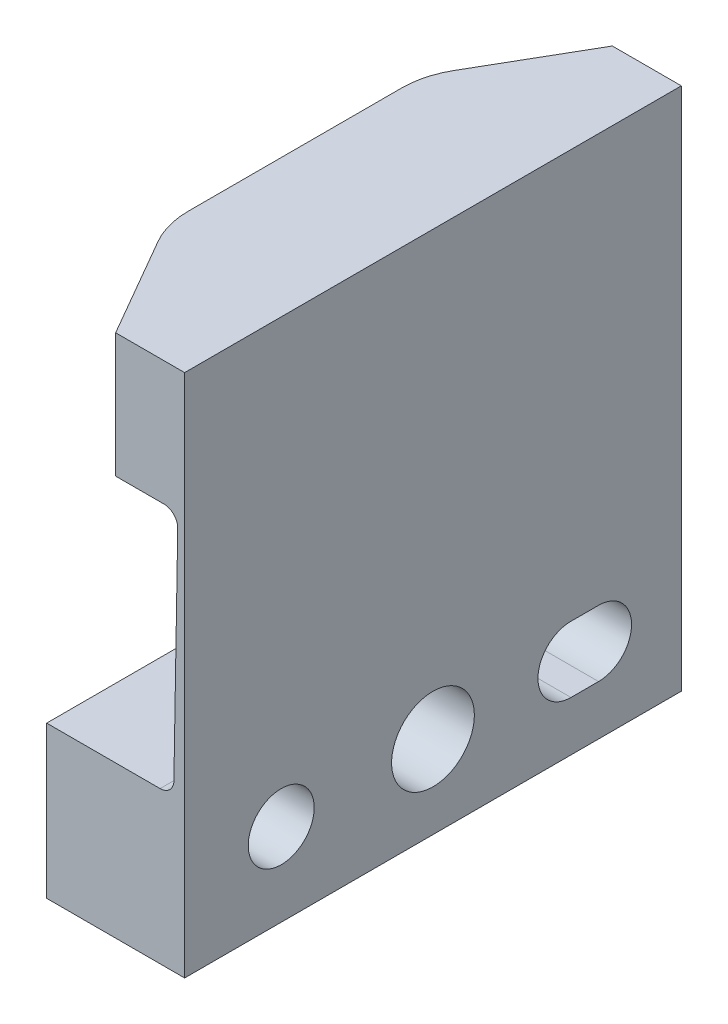
ISO-10303-21;
HEADER;
FILE_DESCRIPTION(('STEP AP214'),'2;1');
FILE_NAME('part.step','',(''),(''),'','','');
FILE_SCHEMA(('AUTOMOTIVE_DESIGN { 1 0 10303 214 1 1 1 1 }'));
ENDSEC;
DATA;
#1=APPLICATION_CONTEXT('core data for automotive mechanical design processes');
#2=APPLICATION_PROTOCOL_DEFINITION('international standard','automotive_design',2000,#1);
#3=PRODUCT_CONTEXT('',#1,'mechanical');
#4=PRODUCT('Part','Part','',(#3));
#5=PRODUCT_RELATED_PRODUCT_CATEGORY('part','',(#4));
#6=PRODUCT_DEFINITION_FORMATION('','',#4);
#7=PRODUCT_DEFINITION_CONTEXT('part definition',#1,'design');
#8=PRODUCT_DEFINITION('design','',#6,#7);
#9=PRODUCT_DEFINITION_SHAPE('','',#8);
#10=(LENGTH_UNIT() NAMED_UNIT(*) SI_UNIT(.MILLI.,.METRE.));
#11=(NAMED_UNIT(*) PLANE_ANGLE_UNIT() SI_UNIT($,.RADIAN.));
#12=(NAMED_UNIT(*) SI_UNIT($,.STERADIAN.) SOLID_ANGLE_UNIT());
#13=UNCERTAINTY_MEASURE_WITH_UNIT(LENGTH_MEASURE(1.E-05),#10,'distance_accuracy_value','');
#14=(GEOMETRIC_REPRESENTATION_CONTEXT(3) GLOBAL_UNCERTAINTY_ASSIGNED_CONTEXT((#13)) GLOBAL_UNIT_ASSIGNED_CONTEXT((#10,
#11,#12)) REPRESENTATION_CONTEXT('',''));
#15=CARTESIAN_POINT('',(0.,0.,0.));
#16=DIRECTION('',(0.,0.,1.));
#17=DIRECTION('',(1.,0.,0.));
#18=AXIS2_PLACEMENT_3D('',#15,#16,#17);
#19=CARTESIAN_POINT('',(0.,19.5,9.));
#20=DIRECTION('',(1.,0.,0.));
#21=DIRECTION('',(0.,1.,0.));
#22=AXIS2_PLACEMENT_3D('',#19,#20,#21);
#23=PLANE('',#22);
#24=DIRECTION('',(0.,0.,1.));
#25=VECTOR('',#24,1.);
#26=CARTESIAN_POINT('',(0.,19.,-3.86602540378444));
#27=LINE('',#26,#25);
#28=CARTESIAN_POINT('',(0.,19.,-3.86602540378444));
#29=VERTEX_POINT('',#28);
#30=CARTESIAN_POINT('',(0.,19.,3.86602540378444));
#31=VERTEX_POINT('',#30);
#32=EDGE_CURVE('E172',#29,#31,#27,.T.);
#33=ORIENTED_EDGE('',*,*,#32,.F.);
#34=DIRECTION('',(0.,-1.,0.));
#35=VECTOR('',#34,1.);
#36=CARTESIAN_POINT('',(0.,19.5,-3.86602540378444));
#37=LINE('',#36,#35);
#38=CARTESIAN_POINT('',(0.,14.5,-3.86602540378444));
#39=VERTEX_POINT('',#38);
#40=EDGE_CURVE('E182',#39,#29,#37,.F.);
#41=ORIENTED_EDGE('',*,*,#40,.F.);
#42=DIRECTION('',(0.,0.,-1.));
#43=VECTOR('',#42,1.);
#44=CARTESIAN_POINT('',(0.,14.5,9.));
#45=LINE('',#44,#43);
#46=CARTESIAN_POINT('',(0.,14.5,3.86602540378444));
#47=VERTEX_POINT('',#46);
#48=EDGE_CURVE('E232',#47,#39,#45,.T.);
#49=ORIENTED_EDGE('',*,*,#48,.F.);
#50=DIRECTION('',(0.,-1.,0.));
#51=VECTOR('',#50,1.);
#52=CARTESIAN_POINT('',(0.,19.5,3.86602540378444));
#53=LINE('',#52,#51);
#54=EDGE_CURVE('E184',#47,#31,#53,.F.);
#55=ORIENTED_EDGE('',*,*,#54,.T.);
#56=EDGE_LOOP('',(#33,#41,#49,#55));
#57=FACE_BOUND('',#56,.T.);
#58=ADVANCED_FACE('F48',(#57),#23,.F.);
#59=CARTESIAN_POINT('',(5.,0.,9.));
#60=DIRECTION('',(-1.,0.,0.));
#61=DIRECTION('',(0.,-1.,0.));
#62=AXIS2_PLACEMENT_3D('',#59,#60,#61);
#63=PLANE('',#62);
#64=CARTESIAN_POINT('',(5.,3.,5.5));
#65=DIRECTION('',(1.,0.,0.));
#66=DIRECTION('',(0.,0.,-1.));
#67=AXIS2_PLACEMENT_3D('',#64,#65,#66);
#68=CIRCLE('',#67,1.195625);
#69=CARTESIAN_POINT('',(5.,3.,4.304375));
#70=VERTEX_POINT('',#69);
#71=EDGE_CURVE('E296',#70,#70,#68,.T.);
#72=ORIENTED_EDGE('',*,*,#71,.F.);
#73=EDGE_LOOP('',(#72));
#74=FACE_BOUND('',#73,.T.);
#75=CARTESIAN_POINT('',(5.,3.,0.));
#76=DIRECTION('',(1.,0.,0.));
#77=DIRECTION('',(0.,0.,-1.));
#78=AXIS2_PLACEMENT_3D('',#75,#76,#77);
#79=CIRCLE('',#78,1.5);
#80=CARTESIAN_POINT('',(5.,3.,-1.5));
#81=VERTEX_POINT('',#80);
#82=EDGE_CURVE('E286',#81,#81,#79,.T.);
#83=ORIENTED_EDGE('',*,*,#82,.F.);
#84=EDGE_LOOP('',(#83));
#85=FACE_BOUND('',#84,.T.);
#86=DIRECTION('',(0.,0.,-1.));
#87=VECTOR('',#86,1.);
#88=CARTESIAN_POINT('',(5.,1.804375,-5.));
#89=LINE('',#88,#87);
#90=CARTESIAN_POINT('',(5.,1.804375,-5.));
#91=VERTEX_POINT('',#90);
#92=CARTESIAN_POINT('',(5.,1.804375,-6.));
#93=VERTEX_POINT('',#92);
#94=EDGE_CURVE('E276',#91,#93,#89,.T.);
#95=ORIENTED_EDGE('',*,*,#94,.F.);
#96=CARTESIAN_POINT('',(5.,3.,-5.));
#97=DIRECTION('',(1.,0.,0.));
#98=DIRECTION('',(0.,0.,-1.));
#99=AXIS2_PLACEMENT_3D('',#96,#97,#98);
#100=CIRCLE('',#99,1.195625);
#101=CARTESIAN_POINT('',(5.,4.195625,-5.));
#102=VERTEX_POINT('',#101);
#103=EDGE_CURVE('E262',#102,#91,#100,.T.);
#104=ORIENTED_EDGE('',*,*,#103,.F.);
#105=DIRECTION('',(0.,0.,1.));
#106=VECTOR('',#105,1.);
#107=CARTESIAN_POINT('',(5.,4.195625,-5.));
#108=LINE('',#107,#106);
#109=CARTESIAN_POINT('',(5.,4.195625,-6.));
#110=VERTEX_POINT('',#109);
#111=EDGE_CURVE('E267',#110,#102,#108,.T.);
#112=ORIENTED_EDGE('',*,*,#111,.F.);
#113=CARTESIAN_POINT('',(5.,3.,-6.));
#114=DIRECTION('',(1.,0.,0.));
#115=DIRECTION('',(0.,0.,-1.));
#116=AXIS2_PLACEMENT_3D('',#113,#114,#115);
#117=CIRCLE('',#116,1.195625);
#118=EDGE_CURVE('E279',#93,#110,#117,.T.);
#119=ORIENTED_EDGE('',*,*,#118,.F.);
#120=EDGE_LOOP('',(#95,#104,#112,#119));
#121=FACE_BOUND('',#120,.T.);
#122=DIRECTION('',(0.,0.,-1.));
#123=VECTOR('',#122,1.);
#124=CARTESIAN_POINT('',(5.,19.,9.));
#125=LINE('',#124,#123);
#126=CARTESIAN_POINT('',(5.,19.,9.));
#127=VERTEX_POINT('',#126);
#128=CARTESIAN_POINT('',(5.,19.,-9.));
#129=VERTEX_POINT('',#128);
#130=EDGE_CURVE('E257',#127,#129,#125,.T.);
#131=ORIENTED_EDGE('',*,*,#130,.F.);
#132=DIRECTION('',(0.,1.,0.));
#133=VECTOR('',#132,1.);
#134=CARTESIAN_POINT('',(5.,0.,9.));
#135=LINE('',#134,#133);
#136=CARTESIAN_POINT('',(5.,0.,9.));
#137=VERTEX_POINT('',#136);
#138=EDGE_CURVE('E215',#137,#127,#135,.T.);
#139=ORIENTED_EDGE('',*,*,#138,.F.);
#140=DIRECTION('',(0.,0.,-1.));
#141=VECTOR('',#140,1.);
#142=CARTESIAN_POINT('',(5.,0.,9.));
#143=LINE('',#142,#141);
#144=CARTESIAN_POINT('',(5.,0.,-9.));
#145=VERTEX_POINT('',#144);
#146=EDGE_CURVE('E218',#137,#145,#143,.T.);
#147=ORIENTED_EDGE('',*,*,#146,.T.);
#148=DIRECTION('',(0.,1.,0.));
#149=VECTOR('',#148,1.);
#150=CARTESIAN_POINT('',(5.,0.,-9.));
#151=LINE('',#150,#149);
#152=EDGE_CURVE('E325',#145,#129,#151,.T.);
#153=ORIENTED_EDGE('',*,*,#152,.T.);
#154=EDGE_LOOP('',(#131,#139,#147,#153));
#155=FACE_BOUND('',#154,.T.);
#156=ADVANCED_FACE('F349',(#74,#85,#121,#155),#63,.F.);
#157=CARTESIAN_POINT('',(4.25007615242181,14.,9.));
#158=DIRECTION('',(0.,0.,-1.));
#159=DIRECTION('',(-1.,0.,0.));
#160=AXIS2_PLACEMENT_3D('',#157,#158,#159);
#161=PLANE('',#160);
#162=DIRECTION('',(1.,0.,0.));
#163=VECTOR('',#162,1.);
#164=CARTESIAN_POINT('',(2.50000000000001,19.,9.));
#165=LINE('',#164,#163);
#166=CARTESIAN_POINT('',(2.50000000000001,19.,9.));
#167=VERTEX_POINT('',#166);
#168=EDGE_CURVE('E253',#167,#127,#165,.T.);
#169=ORIENTED_EDGE('',*,*,#168,.F.);
#170=DIRECTION('',(0.,-1.,0.));
#171=VECTOR('',#170,1.);
#172=CARTESIAN_POINT('',(2.50000000000001,14.,9.));
#173=LINE('',#172,#171);
#174=CARTESIAN_POINT('',(2.5,14.5,9.));
#175=VERTEX_POINT('',#174);
#176=EDGE_CURVE('E234',#167,#175,#173,.T.);
#177=ORIENTED_EDGE('',*,*,#176,.T.);
#178=DIRECTION('',(1.,0.,0.));
#179=VECTOR('',#178,1.);
#180=CARTESIAN_POINT('',(0.,14.5,9.));
#181=LINE('',#180,#179);
#182=CARTESIAN_POINT('',(4.25007615242181,14.5,9.));
#183=VERTEX_POINT('',#182);
#184=EDGE_CURVE('E201',#175,#183,#181,.T.);
#185=ORIENTED_EDGE('',*,*,#184,.T.);
#186=CARTESIAN_POINT('',(4.25007615242181,14.,9.));
#187=DIRECTION('',(0.,0.,-1.));
#188=DIRECTION('',(-1.,0.,0.));
#189=AXIS2_PLACEMENT_3D('',#186,#187,#188);
#190=CIRCLE('',#189,0.5);
#191=CARTESIAN_POINT('',(4.75000000000001,13.9912737967814,9.));
#192=VERTEX_POINT('',#191);
#193=EDGE_CURVE('E203',#183,#192,#190,.T.);
#194=ORIENTED_EDGE('',*,*,#193,.T.);
#195=DIRECTION('',(-0.0174524064372768,-0.999847695156391,0.));
#196=VECTOR('',#195,1.);
#197=CARTESIAN_POINT('',(4.75000000000001,13.9912737967814,9.));
#198=LINE('',#197,#196);
#199=CARTESIAN_POINT('',(4.61035948057432,5.99127379678136,9.));
#200=VERTEX_POINT('',#199);
#201=EDGE_CURVE('E205',#192,#200,#198,.T.);
#202=ORIENTED_EDGE('',*,*,#201,.T.);
#203=CARTESIAN_POINT('',(4.11043563299612,6.,9.));
#204=DIRECTION('',(0.,0.,-1.));
#205=DIRECTION('',(-1.,0.,0.));
#206=AXIS2_PLACEMENT_3D('',#203,#204,#205);
#207=CIRCLE('',#206,0.5);
#208=CARTESIAN_POINT('',(4.11043563299612,5.5,9.));
#209=VERTEX_POINT('',#208);
#210=EDGE_CURVE('E207',#200,#209,#207,.T.);
#211=ORIENTED_EDGE('',*,*,#210,.T.);
#212=DIRECTION('',(-1.,0.,0.));
#213=VECTOR('',#212,1.);
#214=CARTESIAN_POINT('',(4.11043563299612,5.5,9.));
#215=LINE('',#214,#213);
#216=CARTESIAN_POINT('',(0.,5.5,9.));
#217=VERTEX_POINT('',#216);
#218=EDGE_CURVE('E209',#209,#217,#215,.T.);
#219=ORIENTED_EDGE('',*,*,#218,.T.);
#220=DIRECTION('',(0.,-1.,0.));
#221=VECTOR('',#220,1.);
#222=CARTESIAN_POINT('',(0.,5.5,9.));
#223=LINE('',#222,#221);
#224=CARTESIAN_POINT('',(0.,0.,9.));
#225=VERTEX_POINT('',#224);
#226=EDGE_CURVE('E211',#217,#225,#223,.T.);
#227=ORIENTED_EDGE('',*,*,#226,.T.);
#228=DIRECTION('',(1.,0.,0.));
#229=VECTOR('',#228,1.);
#230=CARTESIAN_POINT('',(0.,0.,9.));
#231=LINE('',#230,#229);
#232=EDGE_CURVE('E213',#225,#137,#231,.T.);
#233=ORIENTED_EDGE('',*,*,#232,.T.);
#234=ORIENTED_EDGE('',*,*,#138,.T.);
#235=EDGE_LOOP('',(#169,#177,#185,#194,#202,#211,#219,#227,#233,#234));
#236=FACE_BOUND('',#235,.T.);
#237=ADVANCED_FACE('F344',(#236),#161,.F.);
#238=CARTESIAN_POINT('',(2.50000000000001,14.,9.));
#239=DIRECTION('',(0.866025403784438,0.,-0.500000000000001));
#240=DIRECTION('',(-0.500000000000001,0.,-0.866025403784438));
#241=AXIS2_PLACEMENT_3D('',#238,#239,#240);
#242=PLANE('',#241);
#243=ORIENTED_EDGE('',*,*,#176,.F.);
#244=DIRECTION('',(0.500000000000001,0.,0.866025403784438));
#245=VECTOR('',#244,1.);
#246=CARTESIAN_POINT('',(0.401923788646688,19.,5.36602540378444));
#247=LINE('',#246,#245);
#248=CARTESIAN_POINT('',(0.401923788646688,19.,5.36602540378444));
#249=VERTEX_POINT('',#248);
#250=EDGE_CURVE('E246',#249,#167,#247,.T.);
#251=ORIENTED_EDGE('',*,*,#250,.F.);
#252=DIRECTION('',(0.,1.,0.));
#253=VECTOR('',#252,1.);
#254=CARTESIAN_POINT('',(0.401923788646688,14.5,5.36602540378444));
#255=LINE('',#254,#253);
#256=CARTESIAN_POINT('',(0.401923788646687,14.5,5.36602540378444));
#257=VERTEX_POINT('',#256);
#258=EDGE_CURVE('E56',#249,#257,#255,.F.);
#259=ORIENTED_EDGE('',*,*,#258,.T.);
#260=DIRECTION('',(0.500000000000001,0.,0.866025403784438));
#261=VECTOR('',#260,1.);
#262=CARTESIAN_POINT('',(2.50000000000001,14.5,9.));
#263=LINE('',#262,#261);
#264=EDGE_CURVE('E236',#175,#257,#263,.F.);
#265=ORIENTED_EDGE('',*,*,#264,.F.);
#266=EDGE_LOOP('',(#243,#251,#259,#265));
#267=FACE_BOUND('',#266,.T.);
#268=ADVANCED_FACE('F244',(#267),#242,.F.);
#269=CARTESIAN_POINT('',(3.,19.5,3.86602540378444));
#270=DIRECTION('',(0.,1.,0.));
#271=DIRECTION('',(-1.,0.,0.));
#272=AXIS2_PLACEMENT_3D('',#269,#270,#271);
#273=CYLINDRICAL_SURFACE('',#272,3.);
#274=ORIENTED_EDGE('',*,*,#258,.F.);
#275=CARTESIAN_POINT('',(3.,19.,3.86602540378444));
#276=DIRECTION('',(0.,1.,0.));
#277=DIRECTION('',(0.,0.,1.));
#278=AXIS2_PLACEMENT_3D('',#275,#276,#277);
#279=CIRCLE('',#278,3.);
#280=EDGE_CURVE('E185',#31,#249,#279,.T.);
#281=ORIENTED_EDGE('',*,*,#280,.F.);
#282=ORIENTED_EDGE('',*,*,#54,.F.);
#283=CARTESIAN_POINT('',(3.,14.5,3.86602540378444));
#284=DIRECTION('',(0.,1.,0.));
#285=DIRECTION('',(-1.,0.,0.));
#286=AXIS2_PLACEMENT_3D('',#283,#284,#285);
#287=CIRCLE('',#286,3.);
#288=EDGE_CURVE('E13',#257,#47,#287,.F.);
#289=ORIENTED_EDGE('',*,*,#288,.F.);
#290=EDGE_LOOP('',(#274,#281,#282,#289));
#291=FACE_BOUND('',#290,.T.);
#292=ADVANCED_FACE('F50',(#291),#273,.T.);
#293=CARTESIAN_POINT('',(4.25007615242181,14.,-9.));
#294=DIRECTION('',(0.,0.,1.));
#295=DIRECTION('',(-1.,0.,0.));
#296=AXIS2_PLACEMENT_3D('',#293,#294,#295);
#297=PLANE('',#296);
#298=DIRECTION('',(-1.,0.,0.));
#299=VECTOR('',#298,1.);
#300=CARTESIAN_POINT('',(5.,19.,-9.));
#301=LINE('',#300,#299);
#302=CARTESIAN_POINT('',(2.50000000000001,19.,-9.));
#303=VERTEX_POINT('',#302);
#304=EDGE_CURVE('E259',#129,#303,#301,.T.);
#305=ORIENTED_EDGE('',*,*,#304,.F.);
#306=ORIENTED_EDGE('',*,*,#152,.F.);
#307=DIRECTION('',(1.,0.,0.));
#308=VECTOR('',#307,1.);
#309=CARTESIAN_POINT('',(0.,0.,-9.));
#310=LINE('',#309,#308);
#311=CARTESIAN_POINT('',(0.,0.,-9.));
#312=VERTEX_POINT('',#311);
#313=EDGE_CURVE('E322',#312,#145,#310,.T.);
#314=ORIENTED_EDGE('',*,*,#313,.F.);
#315=DIRECTION('',(0.,-1.,0.));
#316=VECTOR('',#315,1.);
#317=CARTESIAN_POINT('',(0.,5.5,-9.));
#318=LINE('',#317,#316);
#319=CARTESIAN_POINT('',(0.,5.5,-9.));
#320=VERTEX_POINT('',#319);
#321=EDGE_CURVE('E319',#320,#312,#318,.T.);
#322=ORIENTED_EDGE('',*,*,#321,.F.);
#323=DIRECTION('',(-1.,0.,0.));
#324=VECTOR('',#323,1.);
#325=CARTESIAN_POINT('',(4.11043563299612,5.5,-9.));
#326=LINE('',#325,#324);
#327=CARTESIAN_POINT('',(4.11043563299612,5.5,-9.));
#328=VERTEX_POINT('',#327);
#329=EDGE_CURVE('E316',#328,#320,#326,.T.);
#330=ORIENTED_EDGE('',*,*,#329,.F.);
#331=CARTESIAN_POINT('',(4.11043563299612,6.,-9.));
#332=DIRECTION('',(0.,0.,-1.));
#333=DIRECTION('',(-1.,0.,0.));
#334=AXIS2_PLACEMENT_3D('',#331,#332,#333);
#335=CIRCLE('',#334,0.5);
#336=CARTESIAN_POINT('',(4.61035948057432,5.99127379678136,-9.));
#337=VERTEX_POINT('',#336);
#338=EDGE_CURVE('E313',#337,#328,#335,.T.);
#339=ORIENTED_EDGE('',*,*,#338,.F.);
#340=DIRECTION('',(-0.0174524064372768,-0.999847695156391,0.));
#341=VECTOR('',#340,1.);
#342=CARTESIAN_POINT('',(4.75000000000001,13.9912737967814,-9.));
#343=LINE('',#342,#341);
#344=CARTESIAN_POINT('',(4.75000000000001,13.9912737967814,-9.));
#345=VERTEX_POINT('',#344);
#346=EDGE_CURVE('E310',#345,#337,#343,.T.);
#347=ORIENTED_EDGE('',*,*,#346,.F.);
#348=CARTESIAN_POINT('',(4.25007615242181,14.,-9.));
#349=DIRECTION('',(0.,0.,-1.));
#350=DIRECTION('',(-1.,0.,0.));
#351=AXIS2_PLACEMENT_3D('',#348,#349,#350);
#352=CIRCLE('',#351,0.5);
#353=CARTESIAN_POINT('',(4.25007615242181,14.5,-9.));
#354=VERTEX_POINT('',#353);
#355=EDGE_CURVE('E307',#354,#345,#352,.T.);
#356=ORIENTED_EDGE('',*,*,#355,.F.);
#357=DIRECTION('',(1.,0.,0.));
#358=VECTOR('',#357,1.);
#359=CARTESIAN_POINT('',(0.,14.5,-9.));
#360=LINE('',#359,#358);
#361=CARTESIAN_POINT('',(2.5,14.5,-9.));
#362=VERTEX_POINT('',#361);
#363=EDGE_CURVE('E302',#362,#354,#360,.T.);
#364=ORIENTED_EDGE('',*,*,#363,.F.);
#365=DIRECTION('',(0.,-1.,0.));
#366=VECTOR('',#365,1.);
#367=CARTESIAN_POINT('',(2.50000000000001,14.,-9.));
#368=LINE('',#367,#366);
#369=EDGE_CURVE('E196',#303,#362,#368,.T.);
#370=ORIENTED_EDGE('',*,*,#369,.F.);
#371=EDGE_LOOP('',(#305,#306,#314,#322,#330,#339,#347,#356,#364,#370));
#372=FACE_BOUND('',#371,.T.);
#373=ADVANCED_FACE('F335',(#372),#297,.F.);
#374=CARTESIAN_POINT('',(2.50000000000001,14.,-9.));
#375=DIRECTION('',(0.866025403784438,0.,0.500000000000001));
#376=DIRECTION('',(-0.500000000000001,0.,0.866025403784438));
#377=AXIS2_PLACEMENT_3D('',#374,#375,#376);
#378=PLANE('',#377);
#379=DIRECTION('',(0.,1.,0.));
#380=VECTOR('',#379,1.);
#381=CARTESIAN_POINT('',(0.401923788646688,14.5,-5.36602540378444));
#382=LINE('',#381,#380);
#383=CARTESIAN_POINT('',(0.401923788646688,19.,-5.36602540378444));
#384=VERTEX_POINT('',#383);
#385=CARTESIAN_POINT('',(0.401923788646687,14.5,-5.36602540378444));
#386=VERTEX_POINT('',#385);
#387=EDGE_CURVE('E191',#384,#386,#382,.F.);
#388=ORIENTED_EDGE('',*,*,#387,.F.);
#389=DIRECTION('',(-0.500000000000001,0.,0.866025403784438));
#390=VECTOR('',#389,1.);
#391=CARTESIAN_POINT('',(2.50000000000001,19.,-9.));
#392=LINE('',#391,#390);
#393=EDGE_CURVE('E63',#303,#384,#392,.T.);
#394=ORIENTED_EDGE('',*,*,#393,.F.);
#395=ORIENTED_EDGE('',*,*,#369,.T.);
#396=DIRECTION('',(0.500000000000001,0.,-0.866025403784438));
#397=VECTOR('',#396,1.);
#398=CARTESIAN_POINT('',(2.50000000000001,14.5,-9.));
#399=LINE('',#398,#397);
#400=EDGE_CURVE('E192',#362,#386,#399,.F.);
#401=ORIENTED_EDGE('',*,*,#400,.T.);
#402=EDGE_LOOP('',(#388,#394,#395,#401));
#403=FACE_BOUND('',#402,.T.);
#404=ADVANCED_FACE('F330',(#403),#378,.F.);
#405=CARTESIAN_POINT('',(3.,19.5,-3.86602540378444));
#406=DIRECTION('',(0.,1.,0.));
#407=DIRECTION('',(-1.,0.,0.));
#408=AXIS2_PLACEMENT_3D('',#405,#406,#407);
#409=CYLINDRICAL_SURFACE('',#408,3.);
#410=ORIENTED_EDGE('',*,*,#40,.T.);
#411=CARTESIAN_POINT('',(3.,19.,-3.86602540378444));
#412=DIRECTION('',(0.,1.,0.));
#413=DIRECTION('',(0.,0.,1.));
#414=AXIS2_PLACEMENT_3D('',#411,#412,#413);
#415=CIRCLE('',#414,3.);
#416=EDGE_CURVE('E169',#384,#29,#415,.T.);
#417=ORIENTED_EDGE('',*,*,#416,.F.);
#418=ORIENTED_EDGE('',*,*,#387,.T.);
#419=CARTESIAN_POINT('',(3.,14.5,-3.86602540378444));
#420=DIRECTION('',(0.,-1.,0.));
#421=DIRECTION('',(-1.,0.,0.));
#422=AXIS2_PLACEMENT_3D('',#419,#420,#421);
#423=CIRCLE('',#422,3.);
#424=EDGE_CURVE('E190',#386,#39,#423,.F.);
#425=ORIENTED_EDGE('',*,*,#424,.T.);
#426=EDGE_LOOP('',(#410,#417,#418,#425));
#427=FACE_BOUND('',#426,.T.);
#428=ADVANCED_FACE('F188',(#427),#409,.T.);
#429=CARTESIAN_POINT('',(0.,14.5,9.));
#430=DIRECTION('',(0.,1.,0.));
#431=DIRECTION('',(-1.,0.,0.));
#432=AXIS2_PLACEMENT_3D('',#429,#430,#431);
#433=PLANE('',#432);
#434=ORIENTED_EDGE('',*,*,#264,.T.);
#435=ORIENTED_EDGE('',*,*,#288,.T.);
#436=ORIENTED_EDGE('',*,*,#48,.T.);
#437=ORIENTED_EDGE('',*,*,#424,.F.);
#438=ORIENTED_EDGE('',*,*,#400,.F.);
#439=ORIENTED_EDGE('',*,*,#363,.T.);
#440=DIRECTION('',(0.,0.,-1.));
#441=VECTOR('',#440,1.);
#442=CARTESIAN_POINT('',(4.25007615242181,14.5,9.));
#443=LINE('',#442,#441);
#444=EDGE_CURVE('E230',#183,#354,#443,.T.);
#445=ORIENTED_EDGE('',*,*,#444,.F.);
#446=ORIENTED_EDGE('',*,*,#184,.F.);
#447=EDGE_LOOP('',(#434,#435,#436,#437,#438,#439,#445,#446));
#448=FACE_BOUND('',#447,.T.);
#449=ADVANCED_FACE('F250',(#448),#433,.F.);
#450=CARTESIAN_POINT('',(4.25007615242181,14.,9.));
#451=DIRECTION('',(0.,0.,-1.));
#452=DIRECTION('',(-1.,0.,0.));
#453=AXIS2_PLACEMENT_3D('',#450,#451,#452);
#454=CYLINDRICAL_SURFACE('',#453,0.5);
#455=ORIENTED_EDGE('',*,*,#444,.T.);
#456=ORIENTED_EDGE('',*,*,#355,.T.);
#457=DIRECTION('',(0.,0.,-1.));
#458=VECTOR('',#457,1.);
#459=CARTESIAN_POINT('',(4.75000000000001,13.9912737967814,9.));
#460=LINE('',#459,#458);
#461=EDGE_CURVE('E228',#192,#345,#460,.T.);
#462=ORIENTED_EDGE('',*,*,#461,.F.);
#463=ORIENTED_EDGE('',*,*,#193,.F.);
#464=EDGE_LOOP('',(#455,#456,#462,#463));
#465=FACE_BOUND('',#464,.T.);
#466=ADVANCED_FACE('F340',(#465),#454,.F.);
#467=CARTESIAN_POINT('',(4.75000000000001,13.9912737967814,9.));
#468=DIRECTION('',(0.999847695156391,-0.0174524064372768,0.));
#469=DIRECTION('',(0.0174524064372768,0.999847695156391,0.));
#470=AXIS2_PLACEMENT_3D('',#467,#468,#469);
#471=PLANE('',#470);
#472=ORIENTED_EDGE('',*,*,#461,.T.);
#473=ORIENTED_EDGE('',*,*,#346,.T.);
#474=DIRECTION('',(0.,0.,-1.));
#475=VECTOR('',#474,1.);
#476=CARTESIAN_POINT('',(4.61035948057432,5.99127379678136,9.));
#477=LINE('',#476,#475);
#478=EDGE_CURVE('E226',#200,#337,#477,.T.);
#479=ORIENTED_EDGE('',*,*,#478,.F.);
#480=ORIENTED_EDGE('',*,*,#201,.F.);
#481=EDGE_LOOP('',(#472,#473,#479,#480));
#482=FACE_BOUND('',#481,.T.);
#483=ADVANCED_FACE('F372',(#482),#471,.F.);
#484=CARTESIAN_POINT('',(4.11043563299612,6.,9.));
#485=DIRECTION('',(0.,0.,-1.));
#486=DIRECTION('',(-1.,0.,0.));
#487=AXIS2_PLACEMENT_3D('',#484,#485,#486);
#488=CYLINDRICAL_SURFACE('',#487,0.5);
#489=ORIENTED_EDGE('',*,*,#478,.T.);
#490=ORIENTED_EDGE('',*,*,#338,.T.);
#491=DIRECTION('',(0.,0.,-1.));
#492=VECTOR('',#491,1.);
#493=CARTESIAN_POINT('',(4.11043563299612,5.5,9.));
#494=LINE('',#493,#492);
#495=EDGE_CURVE('E224',#209,#328,#494,.T.);
#496=ORIENTED_EDGE('',*,*,#495,.F.);
#497=ORIENTED_EDGE('',*,*,#210,.F.);
#498=EDGE_LOOP('',(#489,#490,#496,#497));
#499=FACE_BOUND('',#498,.T.);
#500=ADVANCED_FACE('F370',(#499),#488,.F.);
#501=CARTESIAN_POINT('',(4.11043563299612,5.5,9.));
#502=DIRECTION('',(0.,-1.,0.));
#503=DIRECTION('',(0.,0.,-1.));
#504=AXIS2_PLACEMENT_3D('',#501,#502,#503);
#505=PLANE('',#504);
#506=ORIENTED_EDGE('',*,*,#495,.T.);
#507=ORIENTED_EDGE('',*,*,#329,.T.);
#508=DIRECTION('',(0.,0.,-1.));
#509=VECTOR('',#508,1.);
#510=CARTESIAN_POINT('',(0.,5.5,9.));
#511=LINE('',#510,#509);
#512=EDGE_CURVE('E222',#217,#320,#511,.T.);
#513=ORIENTED_EDGE('',*,*,#512,.F.);
#514=ORIENTED_EDGE('',*,*,#218,.F.);
#515=EDGE_LOOP('',(#506,#507,#513,#514));
#516=FACE_BOUND('',#515,.T.);
#517=ADVANCED_FACE('F365',(#516),#505,.F.);
#518=CARTESIAN_POINT('',(0.,5.5,9.));
#519=DIRECTION('',(1.,0.,0.));
#520=DIRECTION('',(0.,1.,0.));
#521=AXIS2_PLACEMENT_3D('',#518,#519,#520);
#522=PLANE('',#521);
#523=DIRECTION('',(0.,0.,1.));
#524=VECTOR('',#523,1.);
#525=CARTESIAN_POINT('',(0.,4.195625,-5.));
#526=LINE('',#525,#524);
#527=CARTESIAN_POINT('',(0.,4.195625,-6.));
#528=VERTEX_POINT('',#527);
#529=CARTESIAN_POINT('',(0.,4.195625,-5.));
#530=VERTEX_POINT('',#529);
#531=EDGE_CURVE('E271',#528,#530,#526,.T.);
#532=ORIENTED_EDGE('',*,*,#531,.T.);
#533=CARTESIAN_POINT('',(0.,3.,-5.));
#534=DIRECTION('',(1.,0.,0.));
#535=DIRECTION('',(0.,0.,-1.));
#536=AXIS2_PLACEMENT_3D('',#533,#534,#535);
#537=CIRCLE('',#536,1.195625);
#538=CARTESIAN_POINT('',(0.,1.804375,-5.));
#539=VERTEX_POINT('',#538);
#540=EDGE_CURVE('E263',#530,#539,#537,.T.);
#541=ORIENTED_EDGE('',*,*,#540,.T.);
#542=DIRECTION('',(0.,0.,-1.));
#543=VECTOR('',#542,1.);
#544=CARTESIAN_POINT('',(0.,1.804375,-5.));
#545=LINE('',#544,#543);
#546=CARTESIAN_POINT('',(0.,1.804375,-6.));
#547=VERTEX_POINT('',#546);
#548=EDGE_CURVE('E266',#539,#547,#545,.T.);
#549=ORIENTED_EDGE('',*,*,#548,.T.);
#550=CARTESIAN_POINT('',(0.,3.,-6.));
#551=DIRECTION('',(1.,0.,0.));
#552=DIRECTION('',(0.,0.,-1.));
#553=AXIS2_PLACEMENT_3D('',#550,#551,#552);
#554=CIRCLE('',#553,1.195625);
#555=EDGE_CURVE('E71',#547,#528,#554,.T.);
#556=ORIENTED_EDGE('',*,*,#555,.T.);
#557=EDGE_LOOP('',(#532,#541,#549,#556));
#558=FACE_BOUND('',#557,.T.);
#559=CARTESIAN_POINT('',(0.,3.,0.));
#560=DIRECTION('',(1.,0.,0.));
#561=DIRECTION('',(0.,0.,-1.));
#562=AXIS2_PLACEMENT_3D('',#559,#560,#561);
#563=CIRCLE('',#562,1.5);
#564=CARTESIAN_POINT('',(0.,3.,-1.5));
#565=VERTEX_POINT('',#564);
#566=EDGE_CURVE('E293',#565,#565,#563,.T.);
#567=ORIENTED_EDGE('',*,*,#566,.T.);
#568=EDGE_LOOP('',(#567));
#569=FACE_BOUND('',#568,.T.);
#570=CARTESIAN_POINT('',(0.,3.,5.5));
#571=DIRECTION('',(1.,0.,0.));
#572=DIRECTION('',(0.,0.,-1.));
#573=AXIS2_PLACEMENT_3D('',#570,#571,#572);
#574=CIRCLE('',#573,1.195625);
#575=CARTESIAN_POINT('',(0.,3.,4.304375));
#576=VERTEX_POINT('',#575);
#577=EDGE_CURVE('E299',#576,#576,#574,.T.);
#578=ORIENTED_EDGE('',*,*,#577,.T.);
#579=EDGE_LOOP('',(#578));
#580=FACE_BOUND('',#579,.T.);
#581=ORIENTED_EDGE('',*,*,#512,.T.);
#582=ORIENTED_EDGE('',*,*,#321,.T.);
#583=DIRECTION('',(0.,0.,-1.));
#584=VECTOR('',#583,1.);
#585=CARTESIAN_POINT('',(0.,0.,9.));
#586=LINE('',#585,#584);
#587=EDGE_CURVE('E220',#225,#312,#586,.T.);
#588=ORIENTED_EDGE('',*,*,#587,.F.);
#589=ORIENTED_EDGE('',*,*,#226,.F.);
#590=EDGE_LOOP('',(#581,#582,#588,#589));
#591=FACE_BOUND('',#590,.T.);
#592=ADVANCED_FACE('F360',(#558,#569,#580,#591),#522,.F.);
#593=CARTESIAN_POINT('',(0.,0.,9.));
#594=DIRECTION('',(0.,1.,0.));
#595=DIRECTION('',(0.,0.,1.));
#596=AXIS2_PLACEMENT_3D('',#593,#594,#595);
#597=PLANE('',#596);
#598=ORIENTED_EDGE('',*,*,#587,.T.);
#599=ORIENTED_EDGE('',*,*,#313,.T.);
#600=ORIENTED_EDGE('',*,*,#146,.F.);
#601=ORIENTED_EDGE('',*,*,#232,.F.);
#602=EDGE_LOOP('',(#598,#599,#600,#601));
#603=FACE_BOUND('',#602,.T.);
#604=ADVANCED_FACE('F355',(#603),#597,.F.);
#605=CARTESIAN_POINT('',(0.,3.,5.5));
#606=DIRECTION('',(1.,0.,0.));
#607=DIRECTION('',(0.,0.,-1.));
#608=AXIS2_PLACEMENT_3D('',#605,#606,#607);
#609=CYLINDRICAL_SURFACE('',#608,1.195625);
#610=ORIENTED_EDGE('',*,*,#577,.F.);
#611=EDGE_LOOP('',(#610));
#612=FACE_BOUND('',#611,.T.);
#613=ORIENTED_EDGE('',*,*,#71,.T.);
#614=EDGE_LOOP('',(#613));
#615=FACE_BOUND('',#614,.T.);
#616=ADVANCED_FACE('F402',(#612,#615),#609,.F.);
#617=CARTESIAN_POINT('',(0.,3.,0.));
#618=DIRECTION('',(1.,0.,0.));
#619=DIRECTION('',(0.,0.,-1.));
#620=AXIS2_PLACEMENT_3D('',#617,#618,#619);
#621=CYLINDRICAL_SURFACE('',#620,1.5);
#622=ORIENTED_EDGE('',*,*,#566,.F.);
#623=EDGE_LOOP('',(#622));
#624=FACE_BOUND('',#623,.T.);
#625=ORIENTED_EDGE('',*,*,#82,.T.);
#626=EDGE_LOOP('',(#625));
#627=FACE_BOUND('',#626,.T.);
#628=ADVANCED_FACE('F427',(#624,#627),#621,.F.);
#629=CARTESIAN_POINT('',(0.,3.,-5.));
#630=DIRECTION('',(1.,0.,0.));
#631=DIRECTION('',(0.,0.,-1.));
#632=AXIS2_PLACEMENT_3D('',#629,#630,#631);
#633=CYLINDRICAL_SURFACE('',#632,1.195625);
#634=ORIENTED_EDGE('',*,*,#103,.T.);
#635=DIRECTION('',(1.,0.,0.));
#636=VECTOR('',#635,1.);
#637=CARTESIAN_POINT('',(0.,1.804375,-5.));
#638=LINE('',#637,#636);
#639=EDGE_CURVE('E274',#539,#91,#638,.T.);
#640=ORIENTED_EDGE('',*,*,#639,.F.);
#641=ORIENTED_EDGE('',*,*,#540,.F.);
#642=DIRECTION('',(1.,0.,0.));
#643=VECTOR('',#642,1.);
#644=CARTESIAN_POINT('',(0.,4.195625,-5.));
#645=LINE('',#644,#643);
#646=EDGE_CURVE('E284',#530,#102,#645,.T.);
#647=ORIENTED_EDGE('',*,*,#646,.T.);
#648=EDGE_LOOP('',(#634,#640,#641,#647));
#649=FACE_BOUND('',#648,.T.);
#650=ADVANCED_FACE('F435',(#649),#633,.F.);
#651=CARTESIAN_POINT('',(0.,4.195625,-5.));
#652=DIRECTION('',(0.,1.,0.));
#653=DIRECTION('',(0.,0.,1.));
#654=AXIS2_PLACEMENT_3D('',#651,#652,#653);
#655=PLANE('',#654);
#656=ORIENTED_EDGE('',*,*,#111,.T.);
#657=ORIENTED_EDGE('',*,*,#646,.F.);
#658=ORIENTED_EDGE('',*,*,#531,.F.);
#659=DIRECTION('',(1.,0.,0.));
#660=VECTOR('',#659,1.);
#661=CARTESIAN_POINT('',(0.,4.195625,-6.));
#662=LINE('',#661,#660);
#663=EDGE_CURVE('E287',#528,#110,#662,.T.);
#664=ORIENTED_EDGE('',*,*,#663,.T.);
#665=EDGE_LOOP('',(#656,#657,#658,#664));
#666=FACE_BOUND('',#665,.T.);
#667=ADVANCED_FACE('F443',(#666),#655,.F.);
#668=CARTESIAN_POINT('',(0.,3.,-6.));
#669=DIRECTION('',(1.,0.,0.));
#670=DIRECTION('',(0.,0.,-1.));
#671=AXIS2_PLACEMENT_3D('',#668,#669,#670);
#672=CYLINDRICAL_SURFACE('',#671,1.195625);
#673=ORIENTED_EDGE('',*,*,#118,.T.);
#674=ORIENTED_EDGE('',*,*,#663,.F.);
#675=ORIENTED_EDGE('',*,*,#555,.F.);
#676=DIRECTION('',(1.,0.,0.));
#677=VECTOR('',#676,1.);
#678=CARTESIAN_POINT('',(0.,1.804375,-6.));
#679=LINE('',#678,#677);
#680=EDGE_CURVE('E289',#547,#93,#679,.T.);
#681=ORIENTED_EDGE('',*,*,#680,.T.);
#682=EDGE_LOOP('',(#673,#674,#675,#681));
#683=FACE_BOUND('',#682,.T.);
#684=ADVANCED_FACE('F451',(#683),#672,.F.);
#685=CARTESIAN_POINT('',(0.,1.804375,-5.));
#686=DIRECTION('',(0.,-1.,0.));
#687=DIRECTION('',(0.,0.,-1.));
#688=AXIS2_PLACEMENT_3D('',#685,#686,#687);
#689=PLANE('',#688);
#690=ORIENTED_EDGE('',*,*,#94,.T.);
#691=ORIENTED_EDGE('',*,*,#680,.F.);
#692=ORIENTED_EDGE('',*,*,#548,.F.);
#693=ORIENTED_EDGE('',*,*,#639,.T.);
#694=EDGE_LOOP('',(#690,#691,#692,#693));
#695=FACE_BOUND('',#694,.T.);
#696=ADVANCED_FACE('F459',(#695),#689,.F.);
#697=CARTESIAN_POINT('',(3.,19.,-3.86602540378444));
#698=DIRECTION('',(0.,1.,0.));
#699=DIRECTION('',(0.,0.,1.));
#700=AXIS2_PLACEMENT_3D('',#697,#698,#699);
#701=PLANE('',#700);
#702=ORIENTED_EDGE('',*,*,#416,.T.);
#703=ORIENTED_EDGE('',*,*,#32,.T.);
#704=ORIENTED_EDGE('',*,*,#280,.T.);
#705=ORIENTED_EDGE('',*,*,#250,.T.);
#706=ORIENTED_EDGE('',*,*,#168,.T.);
#707=ORIENTED_EDGE('',*,*,#130,.T.);
#708=ORIENTED_EDGE('',*,*,#304,.T.);
#709=ORIENTED_EDGE('',*,*,#393,.T.);
#710=EDGE_LOOP('',(#702,#703,#704,#705,#706,#707,#708,#709));
#711=FACE_BOUND('',#710,.T.);
#712=ADVANCED_FACE('F171',(#711),#701,.T.);
#713=CLOSED_SHELL('',(#58,#156,#237,#268,#292,#373,#404,#428,#449,#466,#483,#500,#517,#592,#604,
#616,#628,#650,#667,#684,#696,#712));
#714=MANIFOLD_SOLID_BREP('B2',#713);
#715=ADVANCED_BREP_SHAPE_REPRESENTATION('',(#18,#714),#14);
#716=SHAPE_DEFINITION_REPRESENTATION(#9,#715);
ENDSEC;
END-ISO-10303-21;
